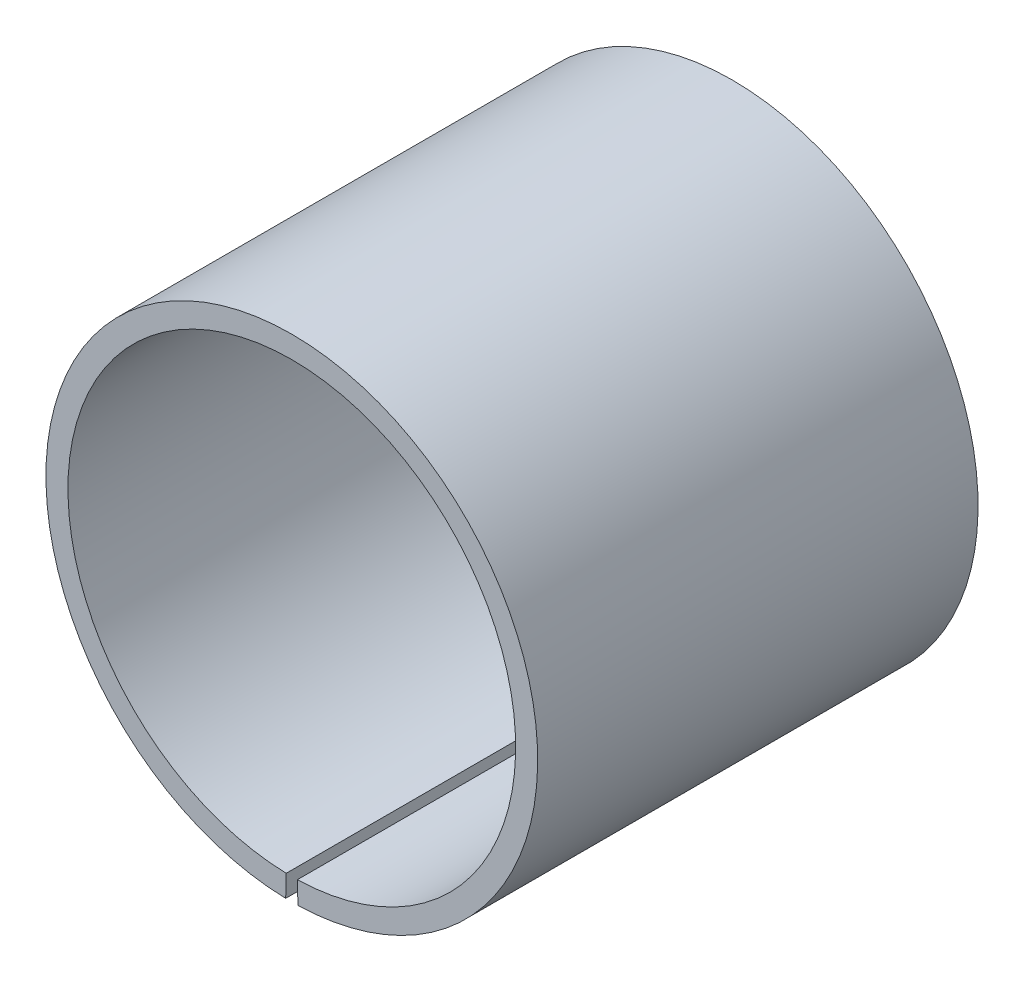
ISO-10303-21;
HEADER;
FILE_DESCRIPTION(('STEP AP214'),'2;1');
FILE_NAME('part.step','',(''),(''),'','','');
FILE_SCHEMA(('AUTOMOTIVE_DESIGN { 1 0 10303 214 1 1 1 1 }'));
ENDSEC;
DATA;
#1=APPLICATION_CONTEXT('core data for automotive mechanical design processes');
#2=APPLICATION_PROTOCOL_DEFINITION('international standard','automotive_design',2000,#1);
#3=PRODUCT_CONTEXT('',#1,'mechanical');
#4=PRODUCT('Part','Part','',(#3));
#5=PRODUCT_RELATED_PRODUCT_CATEGORY('part','',(#4));
#6=PRODUCT_DEFINITION_FORMATION('','',#4);
#7=PRODUCT_DEFINITION_CONTEXT('part definition',#1,'design');
#8=PRODUCT_DEFINITION('design','',#6,#7);
#9=PRODUCT_DEFINITION_SHAPE('','',#8);
#10=(LENGTH_UNIT() NAMED_UNIT(*) SI_UNIT(.MILLI.,.METRE.));
#11=(NAMED_UNIT(*) PLANE_ANGLE_UNIT() SI_UNIT($,.RADIAN.));
#12=(NAMED_UNIT(*) SI_UNIT($,.STERADIAN.) SOLID_ANGLE_UNIT());
#13=UNCERTAINTY_MEASURE_WITH_UNIT(LENGTH_MEASURE(1.E-05),#10,'distance_accuracy_value','');
#14=(GEOMETRIC_REPRESENTATION_CONTEXT(3) GLOBAL_UNCERTAINTY_ASSIGNED_CONTEXT((#13)) GLOBAL_UNIT_ASSIGNED_CONTEXT((#10,
#11,#12)) REPRESENTATION_CONTEXT('',''));
#15=CARTESIAN_POINT('',(0.,0.,0.));
#16=DIRECTION('',(0.,0.,1.));
#17=DIRECTION('',(1.,0.,0.));
#18=AXIS2_PLACEMENT_3D('',#15,#16,#17);
#19=CARTESIAN_POINT('',(0.,0.,15.));
#20=DIRECTION('',(0.,0.,-1.));
#21=DIRECTION('',(-1.,0.,0.));
#22=AXIS2_PLACEMENT_3D('',#19,#20,#21);
#23=CYLINDRICAL_SURFACE('',#22,15.25);
#24=CARTESIAN_POINT('',(0.,0.,-15.));
#25=DIRECTION('',(0.,0.,-1.));
#26=DIRECTION('',(1.,0.,0.));
#27=AXIS2_PLACEMENT_3D('',#24,#25,#26);
#28=CIRCLE('',#27,15.25);
#29=CARTESIAN_POINT('',(-0.379746263251043,-15.2452711611026,-15.));
#30=VERTEX_POINT('',#29);
#31=CARTESIAN_POINT('',(0.379746263251047,-15.2452711611026,-15.));
#32=VERTEX_POINT('',#31);
#33=EDGE_CURVE('E98',#30,#32,#28,.T.);
#34=ORIENTED_EDGE('',*,*,#33,.T.);
#35=DIRECTION('',(0.,0.,-1.));
#36=VECTOR('',#35,1.);
#37=CARTESIAN_POINT('',(0.379746263251047,-15.2452711611026,15.));
#38=LINE('',#37,#36);
#39=CARTESIAN_POINT('',(0.379746263251047,-15.2452711611026,15.));
#40=VERTEX_POINT('',#39);
#41=EDGE_CURVE('E11',#40,#32,#38,.T.);
#42=ORIENTED_EDGE('',*,*,#41,.F.);
#43=CARTESIAN_POINT('',(0.,0.,15.));
#44=DIRECTION('',(0.,0.,-1.));
#45=DIRECTION('',(1.,0.,0.));
#46=AXIS2_PLACEMENT_3D('',#43,#44,#45);
#47=CIRCLE('',#46,15.25);
#48=CARTESIAN_POINT('',(-0.379746263251043,-15.2452711611026,15.));
#49=VERTEX_POINT('',#48);
#50=EDGE_CURVE('E86',#49,#40,#47,.T.);
#51=ORIENTED_EDGE('',*,*,#50,.F.);
#52=DIRECTION('',(0.,0.,-1.));
#53=VECTOR('',#52,1.);
#54=CARTESIAN_POINT('',(-0.379746263251043,-15.2452711611026,15.));
#55=LINE('',#54,#53);
#56=EDGE_CURVE('E94',#49,#30,#55,.T.);
#57=ORIENTED_EDGE('',*,*,#56,.T.);
#58=EDGE_LOOP('',(#34,#42,#51,#57));
#59=FACE_BOUND('',#58,.T.);
#60=ADVANCED_FACE('F35',(#59),#23,.F.);
#61=CARTESIAN_POINT('',(0.417098354718363,-16.7448060294078,15.));
#62=DIRECTION('',(0.99968991220345,0.024901394311544,0.));
#63=DIRECTION('',(-0.024901394311544,0.99968991220345,0.));
#64=AXIS2_PLACEMENT_3D('',#61,#62,#63);
#65=PLANE('',#64);
#66=DIRECTION('',(0.024901394311544,-0.99968991220345,0.));
#67=VECTOR('',#66,1.);
#68=CARTESIAN_POINT('',(0.417098354718363,-16.7448060294078,-15.));
#69=LINE('',#68,#67);
#70=CARTESIAN_POINT('',(0.417098354718366,-16.7448060294078,-15.));
#71=VERTEX_POINT('',#70);
#72=EDGE_CURVE('E90',#32,#71,#69,.T.);
#73=ORIENTED_EDGE('',*,*,#72,.T.);
#74=DIRECTION('',(0.,0.,-1.));
#75=VECTOR('',#74,1.);
#76=CARTESIAN_POINT('',(0.417098354718366,-16.7448060294078,15.));
#77=LINE('',#76,#75);
#78=CARTESIAN_POINT('',(0.417098354718366,-16.7448060294078,15.));
#79=VERTEX_POINT('',#78);
#80=EDGE_CURVE('E43',#79,#71,#77,.T.);
#81=ORIENTED_EDGE('',*,*,#80,.F.);
#82=DIRECTION('',(0.024901394311544,-0.99968991220345,0.));
#83=VECTOR('',#82,1.);
#84=CARTESIAN_POINT('',(0.417098354718363,-16.7448060294078,15.));
#85=LINE('',#84,#83);
#86=EDGE_CURVE('E81',#40,#79,#85,.T.);
#87=ORIENTED_EDGE('',*,*,#86,.F.);
#88=ORIENTED_EDGE('',*,*,#41,.T.);
#89=EDGE_LOOP('',(#73,#81,#87,#88));
#90=FACE_BOUND('',#89,.T.);
#91=ADVANCED_FACE('F89',(#90),#65,.F.);
#92=CARTESIAN_POINT('',(0.,0.,15.));
#93=DIRECTION('',(0.,0.,-1.));
#94=DIRECTION('',(-1.,0.,0.));
#95=AXIS2_PLACEMENT_3D('',#92,#93,#94);
#96=CYLINDRICAL_SURFACE('',#95,16.75);
#97=CARTESIAN_POINT('',(0.,0.,-15.));
#98=DIRECTION('',(0.,0.,1.));
#99=DIRECTION('',(1.,0.,0.));
#100=AXIS2_PLACEMENT_3D('',#97,#98,#99);
#101=CIRCLE('',#100,16.75);
#102=CARTESIAN_POINT('',(-0.417098354718359,-16.7448060294078,-15.));
#103=VERTEX_POINT('',#102);
#104=EDGE_CURVE('E68',#71,#103,#101,.T.);
#105=ORIENTED_EDGE('',*,*,#104,.T.);
#106=DIRECTION('',(0.,0.,-1.));
#107=VECTOR('',#106,1.);
#108=CARTESIAN_POINT('',(-0.417098354718359,-16.7448060294078,15.));
#109=LINE('',#108,#107);
#110=CARTESIAN_POINT('',(-0.417098354718359,-16.7448060294078,15.));
#111=VERTEX_POINT('',#110);
#112=EDGE_CURVE('E91',#111,#103,#109,.T.);
#113=ORIENTED_EDGE('',*,*,#112,.F.);
#114=CARTESIAN_POINT('',(0.,0.,15.));
#115=DIRECTION('',(0.,0.,1.));
#116=DIRECTION('',(1.,0.,0.));
#117=AXIS2_PLACEMENT_3D('',#114,#115,#116);
#118=CIRCLE('',#117,16.75);
#119=EDGE_CURVE('E84',#79,#111,#118,.T.);
#120=ORIENTED_EDGE('',*,*,#119,.F.);
#121=ORIENTED_EDGE('',*,*,#80,.T.);
#122=EDGE_LOOP('',(#105,#113,#120,#121));
#123=FACE_BOUND('',#122,.T.);
#124=ADVANCED_FACE('F92',(#123),#96,.T.);
#125=CARTESIAN_POINT('',(-0.379746263251043,-15.2452711611026,15.));
#126=DIRECTION('',(-0.99968991220345,0.0249013943115438,0.));
#127=DIRECTION('',(-0.0249013943115438,-0.99968991220345,0.));
#128=AXIS2_PLACEMENT_3D('',#125,#126,#127);
#129=PLANE('',#128);
#130=DIRECTION('',(0.0249013943115438,0.99968991220345,0.));
#131=VECTOR('',#130,1.);
#132=CARTESIAN_POINT('',(-0.379746263251043,-15.2452711611026,-15.));
#133=LINE('',#132,#131);
#134=EDGE_CURVE('E74',#103,#30,#133,.T.);
#135=ORIENTED_EDGE('',*,*,#134,.T.);
#136=ORIENTED_EDGE('',*,*,#56,.F.);
#137=DIRECTION('',(0.0249013943115438,0.99968991220345,0.));
#138=VECTOR('',#137,1.);
#139=CARTESIAN_POINT('',(-0.379746263251043,-15.2452711611026,15.));
#140=LINE('',#139,#138);
#141=EDGE_CURVE('E51',#111,#49,#140,.T.);
#142=ORIENTED_EDGE('',*,*,#141,.F.);
#143=ORIENTED_EDGE('',*,*,#112,.T.);
#144=EDGE_LOOP('',(#135,#136,#142,#143));
#145=FACE_BOUND('',#144,.T.);
#146=ADVANCED_FACE('F105',(#145),#129,.F.);
#147=CARTESIAN_POINT('',(0.,0.,15.));
#148=DIRECTION('',(0.,0.,1.));
#149=DIRECTION('',(1.,0.,0.));
#150=AXIS2_PLACEMENT_3D('',#147,#148,#149);
#151=PLANE('',#150);
#152=ORIENTED_EDGE('',*,*,#50,.T.);
#153=ORIENTED_EDGE('',*,*,#86,.T.);
#154=ORIENTED_EDGE('',*,*,#119,.T.);
#155=ORIENTED_EDGE('',*,*,#141,.T.);
#156=EDGE_LOOP('',(#152,#153,#154,#155));
#157=FACE_BOUND('',#156,.T.);
#158=ADVANCED_FACE('F82',(#157),#151,.T.);
#159=CARTESIAN_POINT('',(0.,0.,-15.));
#160=DIRECTION('',(0.,0.,1.));
#161=DIRECTION('',(1.,0.,0.));
#162=AXIS2_PLACEMENT_3D('',#159,#160,#161);
#163=PLANE('',#162);
#164=ORIENTED_EDGE('',*,*,#33,.F.);
#165=ORIENTED_EDGE('',*,*,#134,.F.);
#166=ORIENTED_EDGE('',*,*,#104,.F.);
#167=ORIENTED_EDGE('',*,*,#72,.F.);
#168=EDGE_LOOP('',(#164,#165,#166,#167));
#169=FACE_BOUND('',#168,.T.);
#170=ADVANCED_FACE('F108',(#169),#163,.F.);
#171=CLOSED_SHELL('',(#60,#91,#124,#146,#158,#170));
#172=MANIFOLD_SOLID_BREP('B2',#171);
#173=ADVANCED_BREP_SHAPE_REPRESENTATION('',(#18,#172),#14);
#174=SHAPE_DEFINITION_REPRESENTATION(#9,#173);
ENDSEC;
END-ISO-10303-21;
